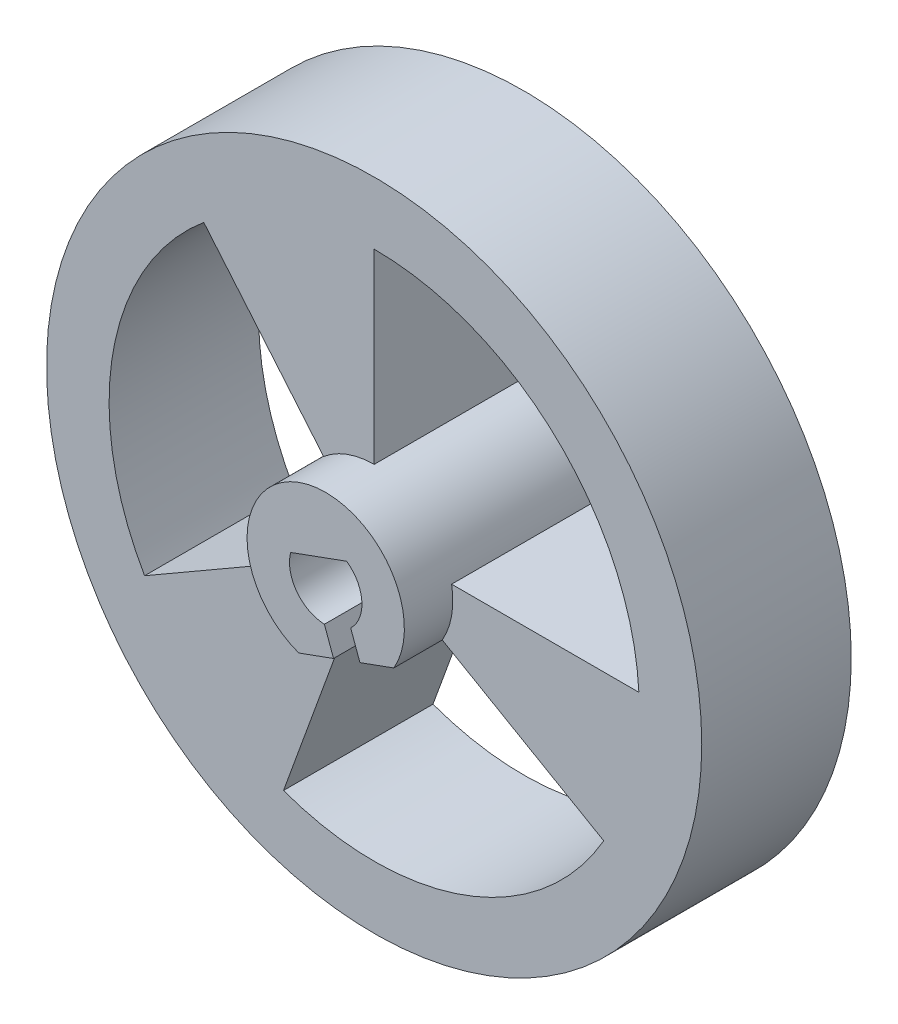
ISO-10303-21;
HEADER;
FILE_DESCRIPTION(('STEP AP214'),'2;1');
FILE_NAME('part.step','',(''),(''),'','','');
FILE_SCHEMA(('AUTOMOTIVE_DESIGN { 1 0 10303 214 1 1 1 1 }'));
ENDSEC;
DATA;
#1=APPLICATION_CONTEXT('core data for automotive mechanical design processes');
#2=APPLICATION_PROTOCOL_DEFINITION('international standard','automotive_design',2000,#1);
#3=PRODUCT_CONTEXT('',#1,'mechanical');
#4=PRODUCT('Part','Part','',(#3));
#5=PRODUCT_RELATED_PRODUCT_CATEGORY('part','',(#4));
#6=PRODUCT_DEFINITION_FORMATION('','',#4);
#7=PRODUCT_DEFINITION_CONTEXT('part definition',#1,'design');
#8=PRODUCT_DEFINITION('design','',#6,#7);
#9=PRODUCT_DEFINITION_SHAPE('','',#8);
#10=(LENGTH_UNIT() NAMED_UNIT(*) SI_UNIT(.MILLI.,.METRE.));
#11=(NAMED_UNIT(*) PLANE_ANGLE_UNIT() SI_UNIT($,.RADIAN.));
#12=(NAMED_UNIT(*) SI_UNIT($,.STERADIAN.) SOLID_ANGLE_UNIT());
#13=UNCERTAINTY_MEASURE_WITH_UNIT(LENGTH_MEASURE(1.E-05),#10,'distance_accuracy_value','');
#14=(GEOMETRIC_REPRESENTATION_CONTEXT(3) GLOBAL_UNCERTAINTY_ASSIGNED_CONTEXT((#13)) GLOBAL_UNIT_ASSIGNED_CONTEXT((#10,
#11,#12)) REPRESENTATION_CONTEXT('',''));
#15=CARTESIAN_POINT('',(0.,0.,0.));
#16=DIRECTION('',(0.,0.,1.));
#17=DIRECTION('',(1.,0.,0.));
#18=AXIS2_PLACEMENT_3D('',#15,#16,#17);
#19=CARTESIAN_POINT('',(15.4523335260827,-18.4153739936729,6.48));
#20=DIRECTION('',(-0.766044443118977,-0.642787609686541,0.));
#21=DIRECTION('',(0.642787609686541,-0.766044443118977,0.));
#22=AXIS2_PLACEMENT_3D('',#19,#20,#21);
#23=PLANE('',#22);
#24=DIRECTION('',(-0.642787609686541,0.766044443118977,0.));
#25=VECTOR('',#24,1.);
#26=CARTESIAN_POINT('',(15.4523335260827,-18.4153739936729,0.));
#27=LINE('',#26,#25);
#28=CARTESIAN_POINT('',(-2.1919057490311,2.61221155103571,0.));
#29=VERTEX_POINT('',#28);
#30=CARTESIAN_POINT('',(-7.38562963529835,8.80185065143704,0.));
#31=VERTEX_POINT('',#30);
#32=EDGE_CURVE('E259',#29,#31,#27,.T.);
#33=ORIENTED_EDGE('',*,*,#32,.F.);
#34=DIRECTION('',(0.,0.,-1.));
#35=VECTOR('',#34,1.);
#36=CARTESIAN_POINT('',(-2.1919057490311,2.61221155103571,6.48));
#37=LINE('',#36,#35);
#38=CARTESIAN_POINT('',(-2.1919057490311,2.61221155103571,6.48));
#39=VERTEX_POINT('',#38);
#40=EDGE_CURVE('E165',#39,#29,#37,.T.);
#41=ORIENTED_EDGE('',*,*,#40,.F.);
#42=DIRECTION('',(-0.642787609686541,0.766044443118977,0.));
#43=VECTOR('',#42,1.);
#44=CARTESIAN_POINT('',(15.4523335260827,-18.4153739936729,6.48));
#45=LINE('',#44,#43);
#46=CARTESIAN_POINT('',(-7.38562963529835,8.80185065143704,6.48));
#47=VERTEX_POINT('',#46);
#48=EDGE_CURVE('E173',#39,#47,#45,.T.);
#49=ORIENTED_EDGE('',*,*,#48,.T.);
#50=DIRECTION('',(0.,0.,-1.));
#51=VECTOR('',#50,1.);
#52=CARTESIAN_POINT('',(-7.38562963529835,8.80185065143704,6.48));
#53=LINE('',#52,#51);
#54=EDGE_CURVE('E54',#47,#31,#53,.T.);
#55=ORIENTED_EDGE('',*,*,#54,.T.);
#56=EDGE_LOOP('',(#33,#41,#49,#55));
#57=FACE_BOUND('',#56,.T.);
#58=ADVANCED_FACE('F35',(#57),#23,.T.);
#59=CARTESIAN_POINT('',(0.,0.,6.48));
#60=DIRECTION('',(0.,0.,-1.));
#61=DIRECTION('',(-1.,0.,0.));
#62=AXIS2_PLACEMENT_3D('',#59,#60,#61);
#63=CYLINDRICAL_SURFACE('',#62,3.41);
#64=CARTESIAN_POINT('',(0.,0.,0.));
#65=DIRECTION('',(0.,0.,1.));
#66=DIRECTION('',(1.,0.,0.));
#67=AXIS2_PLACEMENT_3D('',#64,#65,#66);
#68=CIRCLE('',#67,3.41);
#69=CARTESIAN_POINT('',(-2.95314662690495,-1.70499999999997,0.));
#70=VERTEX_POINT('',#69);
#71=EDGE_CURVE('E177',#29,#70,#68,.T.);
#72=ORIENTED_EDGE('',*,*,#71,.T.);
#73=DIRECTION('',(0.,0.,-1.));
#74=VECTOR('',#73,1.);
#75=CARTESIAN_POINT('',(-2.95314662690495,-1.70499999999997,6.48));
#76=LINE('',#75,#74);
#77=CARTESIAN_POINT('',(-2.95314662690495,-1.70499999999997,6.48));
#78=VERTEX_POINT('',#77);
#79=EDGE_CURVE('E170',#78,#70,#76,.T.);
#80=ORIENTED_EDGE('',*,*,#79,.F.);
#81=CARTESIAN_POINT('',(0.,0.,6.48));
#82=DIRECTION('',(0.,0.,1.));
#83=DIRECTION('',(1.,0.,0.));
#84=AXIS2_PLACEMENT_3D('',#81,#82,#83);
#85=CIRCLE('',#84,3.41);
#86=CARTESIAN_POINT('',(-1.16628868874053,-3.20435183687995,6.48));
#87=VERTEX_POINT('',#86);
#88=EDGE_CURVE('E45',#78,#87,#85,.T.);
#89=ORIENTED_EDGE('',*,*,#88,.T.);
#90=DIRECTION('',(0.,0.,-1.));
#91=VECTOR('',#90,1.);
#92=CARTESIAN_POINT('',(-1.16628868874053,-3.20435183687995,8.58));
#93=LINE('',#92,#91);
#94=CARTESIAN_POINT('',(-1.16628868874053,-3.20435183687995,8.58));
#95=VERTEX_POINT('',#94);
#96=EDGE_CURVE('E337',#95,#87,#93,.T.);
#97=ORIENTED_EDGE('',*,*,#96,.F.);
#98=CARTESIAN_POINT('',(0.,0.,8.58));
#99=DIRECTION('',(0.,0.,1.));
#100=DIRECTION('',(1.,0.,0.));
#101=AXIS2_PLACEMENT_3D('',#98,#99,#100);
#102=CIRCLE('',#101,3.41);
#103=CARTESIAN_POINT('',(2.95314662690493,-1.70500000000002,8.58));
#104=VERTEX_POINT('',#103);
#105=EDGE_CURVE('E325',#104,#95,#102,.T.);
#106=ORIENTED_EDGE('',*,*,#105,.F.);
#107=DIRECTION('',(0.,0.,-1.));
#108=VECTOR('',#107,1.);
#109=CARTESIAN_POINT('',(2.95314662690493,-1.70500000000002,8.58));
#110=LINE('',#109,#108);
#111=CARTESIAN_POINT('',(2.95314662690493,-1.70500000000001,6.48));
#112=VERTEX_POINT('',#111);
#113=EDGE_CURVE('E197',#104,#112,#110,.T.);
#114=ORIENTED_EDGE('',*,*,#113,.T.);
#115=CARTESIAN_POINT('',(3.35819443777163,0.592140285844221,6.48));
#116=VERTEX_POINT('',#115);
#117=EDGE_CURVE('E125',#112,#116,#85,.T.);
#118=ORIENTED_EDGE('',*,*,#117,.T.);
#119=DIRECTION('',(0.,0.,-1.));
#120=VECTOR('',#119,1.);
#121=CARTESIAN_POINT('',(3.35819443777163,0.592140285844221,6.48));
#122=LINE('',#121,#120);
#123=CARTESIAN_POINT('',(3.35819443777163,0.592140285844221,0.));
#124=VERTEX_POINT('',#123);
#125=EDGE_CURVE('E272',#116,#124,#122,.T.);
#126=ORIENTED_EDGE('',*,*,#125,.T.);
#127=CARTESIAN_POINT('',(0.,0.,0.));
#128=DIRECTION('',(0.,0.,1.));
#129=DIRECTION('',(1.,0.,0.));
#130=AXIS2_PLACEMENT_3D('',#127,#128,#129);
#131=CIRCLE('',#130,3.41);
#132=CARTESIAN_POINT('',(0.,3.41,0.));
#133=VERTEX_POINT('',#132);
#134=EDGE_CURVE('E250',#133,#124,#131,.F.);
#135=ORIENTED_EDGE('',*,*,#134,.F.);
#136=DIRECTION('',(0.,0.,-1.));
#137=VECTOR('',#136,1.);
#138=CARTESIAN_POINT('',(0.,3.41,6.48));
#139=LINE('',#138,#137);
#140=CARTESIAN_POINT('',(0.,3.41,6.48));
#141=VERTEX_POINT('',#140);
#142=EDGE_CURVE('E270',#141,#133,#139,.T.);
#143=ORIENTED_EDGE('',*,*,#142,.F.);
#144=EDGE_CURVE('E11',#141,#39,#85,.T.);
#145=ORIENTED_EDGE('',*,*,#144,.T.);
#146=ORIENTED_EDGE('',*,*,#40,.T.);
#147=EDGE_LOOP('',(#72,#80,#89,#97,#106,#114,#118,#126,#135,#143,#145,#146));
#148=FACE_BOUND('',#147,.T.);
#149=ADVANCED_FACE('F175',(#148),#63,.T.);
#150=CARTESIAN_POINT('',(-13.5885540506824,-7.84535533905907,6.48));
#151=DIRECTION('',(0.499999999999992,-0.866025403784443,0.));
#152=DIRECTION('',(0.866025403784443,0.499999999999992,0.));
#153=AXIS2_PLACEMENT_3D('',#150,#151,#152);
#154=PLANE('',#153);
#155=DIRECTION('',(-0.866025403784443,-0.499999999999992,0.));
#156=VECTOR('',#155,1.);
#157=CARTESIAN_POINT('',(-13.5885540506824,-7.84535533905907,0.));
#158=LINE('',#157,#156);
#159=CARTESIAN_POINT('',(-9.95063188948325,-5.74499999999991,0.));
#160=VERTEX_POINT('',#159);
#161=EDGE_CURVE('E262',#70,#160,#158,.T.);
#162=ORIENTED_EDGE('',*,*,#161,.T.);
#163=DIRECTION('',(0.,0.,-1.));
#164=VECTOR('',#163,1.);
#165=CARTESIAN_POINT('',(-9.95063188948325,-5.74499999999991,6.48));
#166=LINE('',#165,#164);
#167=CARTESIAN_POINT('',(-9.95063188948325,-5.74499999999991,6.48));
#168=VERTEX_POINT('',#167);
#169=EDGE_CURVE('E112',#168,#160,#166,.T.);
#170=ORIENTED_EDGE('',*,*,#169,.F.);
#171=DIRECTION('',(-0.866025403784443,-0.499999999999992,0.));
#172=VECTOR('',#171,1.);
#173=CARTESIAN_POINT('',(-13.5885540506824,-7.84535533905907,6.48));
#174=LINE('',#173,#172);
#175=EDGE_CURVE('E156',#78,#168,#174,.T.);
#176=ORIENTED_EDGE('',*,*,#175,.F.);
#177=ORIENTED_EDGE('',*,*,#79,.T.);
#178=EDGE_LOOP('',(#162,#170,#176,#177));
#179=FACE_BOUND('',#178,.T.);
#180=ADVANCED_FACE('F169',(#179),#154,.F.);
#181=CARTESIAN_POINT('',(0.,0.,6.48));
#182=DIRECTION('',(0.,0.,-1.));
#183=DIRECTION('',(-1.,0.,0.));
#184=AXIS2_PLACEMENT_3D('',#181,#182,#183);
#185=CYLINDRICAL_SURFACE('',#184,11.49);
#186=CARTESIAN_POINT('',(0.,0.,0.));
#187=DIRECTION('',(0.,0.,1.));
#188=DIRECTION('',(1.,0.,0.));
#189=AXIS2_PLACEMENT_3D('',#186,#187,#188);
#190=CIRCLE('',#189,11.49);
#191=CARTESIAN_POINT('',(11.4747317999978,0.592140285844221,0.));
#192=VERTEX_POINT('',#191);
#193=CARTESIAN_POINT('',(0.,11.49,0.));
#194=VERTEX_POINT('',#193);
#195=EDGE_CURVE('E244',#192,#194,#190,.T.);
#196=ORIENTED_EDGE('',*,*,#195,.F.);
#197=DIRECTION('',(0.,0.,-1.));
#198=VECTOR('',#197,1.);
#199=CARTESIAN_POINT('',(11.4747317999978,0.592140285844221,6.48));
#200=LINE('',#199,#198);
#201=CARTESIAN_POINT('',(11.4747317999978,0.592140285844221,6.48));
#202=VERTEX_POINT('',#201);
#203=EDGE_CURVE('E266',#202,#192,#200,.T.);
#204=ORIENTED_EDGE('',*,*,#203,.F.);
#205=CARTESIAN_POINT('',(0.,0.,6.48));
#206=DIRECTION('',(0.,0.,1.));
#207=DIRECTION('',(1.,0.,0.));
#208=AXIS2_PLACEMENT_3D('',#205,#206,#207);
#209=CIRCLE('',#208,11.49);
#210=CARTESIAN_POINT('',(0.,11.49,6.48));
#211=VERTEX_POINT('',#210);
#212=EDGE_CURVE('E206',#202,#211,#209,.T.);
#213=ORIENTED_EDGE('',*,*,#212,.T.);
#214=DIRECTION('',(0.,0.,-1.));
#215=VECTOR('',#214,1.);
#216=CARTESIAN_POINT('',(0.,11.49,6.48));
#217=LINE('',#216,#215);
#218=EDGE_CURVE('E268',#211,#194,#217,.T.);
#219=ORIENTED_EDGE('',*,*,#218,.T.);
#220=EDGE_LOOP('',(#196,#204,#213,#219));
#221=FACE_BOUND('',#220,.T.);
#222=ADVANCED_FACE('F399',(#221),#185,.F.);
#223=CARTESIAN_POINT('',(0.,0.592140285844221,6.48));
#224=DIRECTION('',(0.,1.,0.));
#225=DIRECTION('',(0.,0.,1.));
#226=AXIS2_PLACEMENT_3D('',#223,#224,#225);
#227=PLANE('',#226);
#228=DIRECTION('',(1.,0.,0.));
#229=VECTOR('',#228,1.);
#230=CARTESIAN_POINT('',(0.,0.592140285844221,0.));
#231=LINE('',#230,#229);
#232=EDGE_CURVE('E247',#124,#192,#231,.T.);
#233=ORIENTED_EDGE('',*,*,#232,.F.);
#234=ORIENTED_EDGE('',*,*,#125,.F.);
#235=DIRECTION('',(1.,0.,0.));
#236=VECTOR('',#235,1.);
#237=CARTESIAN_POINT('',(0.,0.592140285844221,6.48));
#238=LINE('',#237,#236);
#239=EDGE_CURVE('E209',#116,#202,#238,.T.);
#240=ORIENTED_EDGE('',*,*,#239,.T.);
#241=ORIENTED_EDGE('',*,*,#203,.T.);
#242=EDGE_LOOP('',(#233,#234,#240,#241));
#243=FACE_BOUND('',#242,.T.);
#244=ADVANCED_FACE('F396',(#243),#227,.T.);
#245=CARTESIAN_POINT('',(-9.19236544198871,-6.1256048729982,6.48));
#246=DIRECTION('',(0.342020143325667,-0.939692620785909,0.));
#247=DIRECTION('',(0.939692620785909,0.342020143325667,0.));
#248=AXIS2_PLACEMENT_3D('',#245,#246,#247);
#249=PLANE('',#248);
#250=DIRECTION('',(-0.939692620785909,-0.342020143325667,0.));
#251=VECTOR('',#250,1.);
#252=CARTESIAN_POINT('',(-9.19236544198871,-6.1256048729982,0.));
#253=LINE('',#252,#251);
#254=CARTESIAN_POINT('',(2.95314662690493,-1.70500000000001,0.));
#255=VERTEX_POINT('',#254);
#256=CARTESIAN_POINT('',(1.48342896908221,-2.23993348022293,0.));
#257=VERTEX_POINT('',#256);
#258=EDGE_CURVE('E216',#255,#257,#253,.T.);
#259=ORIENTED_EDGE('',*,*,#258,.F.);
#260=DIRECTION('',(0.,0.,-1.));
#261=VECTOR('',#260,1.);
#262=CARTESIAN_POINT('',(2.95314662690493,-1.70500000000001,6.48));
#263=LINE('',#262,#261);
#264=EDGE_CURVE('E189',#112,#255,#263,.T.);
#265=ORIENTED_EDGE('',*,*,#264,.F.);
#266=ORIENTED_EDGE('',*,*,#113,.F.);
#267=DIRECTION('',(0.939692620785907,0.342020143325673,0.));
#268=VECTOR('',#267,1.);
#269=CARTESIAN_POINT('',(1.48342896908221,-2.23993348022293,8.58));
#270=LINE('',#269,#268);
#271=CARTESIAN_POINT('',(1.48342896908221,-2.23993348022293,8.58));
#272=VERTEX_POINT('',#271);
#273=EDGE_CURVE('E307',#272,#104,#270,.T.);
#274=ORIENTED_EDGE('',*,*,#273,.F.);
#275=DIRECTION('',(0.,0.,-1.));
#276=VECTOR('',#275,1.);
#277=CARTESIAN_POINT('',(1.48342896908221,-2.23993348022293,6.48));
#278=LINE('',#277,#276);
#279=EDGE_CURVE('E215',#272,#257,#278,.T.);
#280=ORIENTED_EDGE('',*,*,#279,.T.);
#281=EDGE_LOOP('',(#259,#265,#266,#274,#280));
#282=FACE_BOUND('',#281,.T.);
#283=ADVANCED_FACE('F302',(#282),#249,.T.);
#284=CARTESIAN_POINT('',(13.5885540506826,-7.84535533905945,6.48));
#285=DIRECTION('',(0.500000000000004,0.866025403784436,0.));
#286=DIRECTION('',(-0.866025403784436,0.500000000000004,0.));
#287=AXIS2_PLACEMENT_3D('',#284,#285,#286);
#288=PLANE('',#287);
#289=DIRECTION('',(0.866025403784436,-0.500000000000004,0.));
#290=VECTOR('',#289,1.);
#291=CARTESIAN_POINT('',(13.5885540506826,-7.84535533905945,0.));
#292=LINE('',#291,#290);
#293=CARTESIAN_POINT('',(9.95063188948317,-5.74500000000005,0.));
#294=VERTEX_POINT('',#293);
#295=EDGE_CURVE('E219',#255,#294,#292,.T.);
#296=ORIENTED_EDGE('',*,*,#295,.T.);
#297=DIRECTION('',(0.,0.,-1.));
#298=VECTOR('',#297,1.);
#299=CARTESIAN_POINT('',(9.95063188948317,-5.74500000000005,6.48));
#300=LINE('',#299,#298);
#301=CARTESIAN_POINT('',(9.95063188948317,-5.74500000000005,6.48));
#302=VERTEX_POINT('',#301);
#303=EDGE_CURVE('E287',#302,#294,#300,.T.);
#304=ORIENTED_EDGE('',*,*,#303,.F.);
#305=DIRECTION('',(0.866025403784436,-0.500000000000004,0.));
#306=VECTOR('',#305,1.);
#307=CARTESIAN_POINT('',(13.5885540506826,-7.84535533905945,6.48));
#308=LINE('',#307,#306);
#309=EDGE_CURVE('E199',#112,#302,#308,.T.);
#310=ORIENTED_EDGE('',*,*,#309,.F.);
#311=ORIENTED_EDGE('',*,*,#264,.T.);
#312=EDGE_LOOP('',(#296,#304,#310,#311));
#313=FACE_BOUND('',#312,.T.);
#314=ADVANCED_FACE('F37',(#313),#288,.F.);
#315=CARTESIAN_POINT('',(0.,0.,6.48));
#316=DIRECTION('',(0.,0.,-1.));
#317=DIRECTION('',(-1.,0.,0.));
#318=AXIS2_PLACEMENT_3D('',#315,#316,#317);
#319=CYLINDRICAL_SURFACE('',#318,11.49);
#320=CARTESIAN_POINT('',(0.,0.,0.));
#321=DIRECTION('',(0.,0.,1.));
#322=DIRECTION('',(1.,0.,0.));
#323=AXIS2_PLACEMENT_3D('',#320,#321,#322);
#324=CIRCLE('',#323,11.49);
#325=CARTESIAN_POINT('',(-3.92981144681191,-10.7970682128301,0.));
#326=VERTEX_POINT('',#325);
#327=EDGE_CURVE('E223',#326,#294,#324,.T.);
#328=ORIENTED_EDGE('',*,*,#327,.F.);
#329=DIRECTION('',(0.,0.,-1.));
#330=VECTOR('',#329,1.);
#331=CARTESIAN_POINT('',(-3.92981144681191,-10.7970682128301,6.48));
#332=LINE('',#331,#330);
#333=CARTESIAN_POINT('',(-3.92981144681191,-10.7970682128301,6.48));
#334=VERTEX_POINT('',#333);
#335=EDGE_CURVE('E286',#334,#326,#332,.T.);
#336=ORIENTED_EDGE('',*,*,#335,.F.);
#337=CARTESIAN_POINT('',(0.,0.,6.48));
#338=DIRECTION('',(0.,0.,1.));
#339=DIRECTION('',(1.,0.,0.));
#340=AXIS2_PLACEMENT_3D('',#337,#338,#339);
#341=CIRCLE('',#340,11.49);
#342=EDGE_CURVE('E201',#334,#302,#341,.T.);
#343=ORIENTED_EDGE('',*,*,#342,.T.);
#344=ORIENTED_EDGE('',*,*,#303,.T.);
#345=EDGE_LOOP('',(#328,#336,#343,#344));
#346=FACE_BOUND('',#345,.T.);
#347=ADVANCED_FACE('F442',(#346),#319,.F.);
#348=CARTESIAN_POINT('',(-10.0857944110709,-27.7104924016791,6.48));
#349=DIRECTION('',(0.939692620785909,-0.342020143325667,0.));
#350=DIRECTION('',(0.342020143325667,0.939692620785909,0.));
#351=AXIS2_PLACEMENT_3D('',#348,#349,#350);
#352=PLANE('',#351);
#353=DIRECTION('',(-0.342020143325667,-0.939692620785909,0.));
#354=VECTOR('',#353,1.);
#355=CARTESIAN_POINT('',(-10.0857944110709,-27.7104924016791,0.));
#356=LINE('',#355,#354);
#357=CARTESIAN_POINT('',(-1.16628868874053,-3.20435183687995,0.));
#358=VERTEX_POINT('',#357);
#359=EDGE_CURVE('E226',#358,#326,#356,.T.);
#360=ORIENTED_EDGE('',*,*,#359,.F.);
#361=DIRECTION('',(0.,0.,-1.));
#362=VECTOR('',#361,1.);
#363=CARTESIAN_POINT('',(-1.16628868874053,-3.20435183687995,6.48));
#364=LINE('',#363,#362);
#365=EDGE_CURVE('E284',#87,#358,#364,.T.);
#366=ORIENTED_EDGE('',*,*,#365,.F.);
#367=DIRECTION('',(-0.342020143325667,-0.939692620785909,0.));
#368=VECTOR('',#367,1.);
#369=CARTESIAN_POINT('',(-10.0857944110709,-27.7104924016791,6.48));
#370=LINE('',#369,#368);
#371=EDGE_CURVE('E159',#87,#334,#370,.T.);
#372=ORIENTED_EDGE('',*,*,#371,.T.);
#373=ORIENTED_EDGE('',*,*,#335,.T.);
#374=EDGE_LOOP('',(#360,#366,#372,#373));
#375=FACE_BOUND('',#374,.T.);
#376=ADVANCED_FACE('F448',(#375),#352,.T.);
#377=CARTESIAN_POINT('',(0.339010322818524,-2.65646780300213,0.));
#378=VERTEX_POINT('',#377);
#379=EDGE_CURVE('E220',#378,#358,#253,.T.);
#380=ORIENTED_EDGE('',*,*,#379,.F.);
#381=DIRECTION('',(0.,0.,-1.));
#382=VECTOR('',#381,1.);
#383=CARTESIAN_POINT('',(0.339010322818524,-2.65646780300213,6.48));
#384=LINE('',#383,#382);
#385=CARTESIAN_POINT('',(0.339010322818524,-2.65646780300213,8.58));
#386=VERTEX_POINT('',#385);
#387=EDGE_CURVE('E282',#386,#378,#384,.T.);
#388=ORIENTED_EDGE('',*,*,#387,.F.);
#389=DIRECTION('',(0.939692620785911,0.342020143325662,0.));
#390=VECTOR('',#389,1.);
#391=CARTESIAN_POINT('',(0.339010322818524,-2.65646780300213,8.58));
#392=LINE('',#391,#390);
#393=EDGE_CURVE('E332',#95,#386,#392,.T.);
#394=ORIENTED_EDGE('',*,*,#393,.F.);
#395=ORIENTED_EDGE('',*,*,#96,.T.);
#396=ORIENTED_EDGE('',*,*,#365,.T.);
#397=EDGE_LOOP('',(#380,#388,#394,#395,#396));
#398=FACE_BOUND('',#397,.T.);
#399=ADVANCED_FACE('F436',(#398),#249,.T.);
#400=CARTESIAN_POINT('',(9.53137576480724,-27.9122842862412,6.48));
#401=DIRECTION('',(0.939692620785909,0.342020143325668,0.));
#402=DIRECTION('',(-0.342020143325668,0.939692620785909,0.));
#403=AXIS2_PLACEMENT_3D('',#400,#401,#402);
#404=PLANE('',#403);
#405=DIRECTION('',(0.342020143325668,-0.939692620785909,0.));
#406=VECTOR('',#405,1.);
#407=CARTESIAN_POINT('',(9.53137576480724,-27.9122842862412,0.));
#408=LINE('',#407,#406);
#409=CARTESIAN_POINT('',(-0.0568057832839673,-1.56897198922909,0.));
#410=VERTEX_POINT('',#409);
#411=EDGE_CURVE('E229',#410,#378,#408,.T.);
#412=ORIENTED_EDGE('',*,*,#411,.F.);
#413=DIRECTION('',(0.,0.,-1.));
#414=VECTOR('',#413,1.);
#415=CARTESIAN_POINT('',(-0.0568057832839673,-1.56897198922909,6.48));
#416=LINE('',#415,#414);
#417=CARTESIAN_POINT('',(-0.0568057832839673,-1.56897198922909,8.58));
#418=VERTEX_POINT('',#417);
#419=EDGE_CURVE('E280',#418,#410,#416,.T.);
#420=ORIENTED_EDGE('',*,*,#419,.F.);
#421=DIRECTION('',(-0.342020143325671,0.939692620785908,0.));
#422=VECTOR('',#421,1.);
#423=CARTESIAN_POINT('',(-0.0568057832839673,-1.56897198922909,8.58));
#424=LINE('',#423,#422);
#425=EDGE_CURVE('E335',#386,#418,#424,.T.);
#426=ORIENTED_EDGE('',*,*,#425,.F.);
#427=ORIENTED_EDGE('',*,*,#387,.T.);
#428=EDGE_LOOP('',(#412,#420,#426,#427));
#429=FACE_BOUND('',#428,.T.);
#430=ADVANCED_FACE('F352',(#429),#404,.T.);
#431=CARTESIAN_POINT('',(0.,0.,6.48));
#432=DIRECTION('',(0.,0.,-1.));
#433=DIRECTION('',(-1.,0.,0.));
#434=AXIS2_PLACEMENT_3D('',#431,#432,#433);
#435=CYLINDRICAL_SURFACE('',#434,1.57);
#436=CARTESIAN_POINT('',(0.,0.,0.));
#437=DIRECTION('',(0.,0.,1.));
#438=DIRECTION('',(1.,0.,0.));
#439=AXIS2_PLACEMENT_3D('',#436,#437,#438);
#440=CIRCLE('',#439,1.57);
#441=CARTESIAN_POINT('',(-1.51946574338497,0.395125112691618,0.));
#442=VERTEX_POINT('',#441);
#443=EDGE_CURVE('E232',#442,#410,#440,.T.);
#444=ORIENTED_EDGE('',*,*,#443,.F.);
#445=DIRECTION('',(0.,0.,-1.));
#446=VECTOR('',#445,1.);
#447=CARTESIAN_POINT('',(-1.51946574338497,0.395125112691618,6.48));
#448=LINE('',#447,#446);
#449=CARTESIAN_POINT('',(-1.51946574338497,0.395125112691618,8.58));
#450=VERTEX_POINT('',#449);
#451=EDGE_CURVE('E278',#450,#442,#448,.T.);
#452=ORIENTED_EDGE('',*,*,#451,.F.);
#453=CARTESIAN_POINT('',(0.,0.,8.58));
#454=DIRECTION('',(0.,0.,-1.));
#455=DIRECTION('',(1.,0.,0.));
#456=AXIS2_PLACEMENT_3D('',#453,#454,#455);
#457=CIRCLE('',#456,1.57);
#458=EDGE_CURVE('E196',#418,#450,#457,.T.);
#459=ORIENTED_EDGE('',*,*,#458,.F.);
#460=ORIENTED_EDGE('',*,*,#419,.T.);
#461=EDGE_LOOP('',(#444,#452,#459,#460));
#462=FACE_BOUND('',#461,.T.);
#463=ADVANCED_FACE('F358',(#462),#435,.F.);
#464=CARTESIAN_POINT('',(-10.3905289015056,-2.83367782315982,6.48));
#465=DIRECTION('',(-0.342020143325667,0.939692620785909,0.));
#466=DIRECTION('',(-0.939692620785909,-0.342020143325667,0.));
#467=AXIS2_PLACEMENT_3D('',#464,#465,#466);
#468=PLANE('',#467);
#469=DIRECTION('',(0.939692620785909,0.342020143325667,0.));
#470=VECTOR('',#469,1.);
#471=CARTESIAN_POINT('',(-10.3905289015056,-2.83367782315982,0.));
#472=LINE('',#471,#470);
#473=CARTESIAN_POINT('',(0.909996762515537,1.27937715010518,0.));
#474=VERTEX_POINT('',#473);
#475=EDGE_CURVE('E235',#442,#474,#472,.T.);
#476=ORIENTED_EDGE('',*,*,#475,.T.);
#477=DIRECTION('',(0.,0.,-1.));
#478=VECTOR('',#477,1.);
#479=CARTESIAN_POINT('',(0.909996762515537,1.27937715010518,6.48));
#480=LINE('',#479,#478);
#481=CARTESIAN_POINT('',(0.909996762515537,1.27937715010518,8.58));
#482=VERTEX_POINT('',#481);
#483=EDGE_CURVE('E276',#482,#474,#480,.T.);
#484=ORIENTED_EDGE('',*,*,#483,.F.);
#485=DIRECTION('',(0.939692620785909,0.342020143325668,0.));
#486=VECTOR('',#485,1.);
#487=CARTESIAN_POINT('',(-1.51946574338497,0.395125112691618,8.58));
#488=LINE('',#487,#486);
#489=EDGE_CURVE('E327',#450,#482,#488,.T.);
#490=ORIENTED_EDGE('',*,*,#489,.F.);
#491=ORIENTED_EDGE('',*,*,#451,.T.);
#492=EDGE_LOOP('',(#476,#484,#490,#491));
#493=FACE_BOUND('',#492,.T.);
#494=ADVANCED_FACE('F371',(#493),#468,.F.);
#495=CARTESIAN_POINT('',(0.,0.,6.48));
#496=DIRECTION('',(0.,0.,-1.));
#497=DIRECTION('',(-1.,0.,0.));
#498=AXIS2_PLACEMENT_3D('',#495,#496,#497);
#499=CYLINDRICAL_SURFACE('',#498,1.57);
#500=CARTESIAN_POINT('',(0.,0.,0.));
#501=DIRECTION('',(0.,0.,1.));
#502=DIRECTION('',(1.,0.,0.));
#503=AXIS2_PLACEMENT_3D('',#500,#501,#502);
#504=CIRCLE('',#503,1.57);
#505=CARTESIAN_POINT('',(1.0821627894372,-1.13746371245746,0.));
#506=VERTEX_POINT('',#505);
#507=EDGE_CURVE('E238',#506,#474,#504,.T.);
#508=ORIENTED_EDGE('',*,*,#507,.F.);
#509=DIRECTION('',(0.,0.,-1.));
#510=VECTOR('',#509,1.);
#511=CARTESIAN_POINT('',(1.0821627894372,-1.13746371245746,6.48));
#512=LINE('',#511,#510);
#513=CARTESIAN_POINT('',(1.0821627894372,-1.13746371245746,8.58));
#514=VERTEX_POINT('',#513);
#515=EDGE_CURVE('E274',#514,#506,#512,.T.);
#516=ORIENTED_EDGE('',*,*,#515,.F.);
#517=CARTESIAN_POINT('',(0.,0.,8.58));
#518=DIRECTION('',(0.,0.,-1.));
#519=DIRECTION('',(1.,0.,0.));
#520=AXIS2_PLACEMENT_3D('',#517,#518,#519);
#521=CIRCLE('',#520,1.57);
#522=EDGE_CURVE('E323',#482,#514,#521,.T.);
#523=ORIENTED_EDGE('',*,*,#522,.F.);
#524=ORIENTED_EDGE('',*,*,#483,.T.);
#525=EDGE_LOOP('',(#508,#516,#523,#524));
#526=FACE_BOUND('',#525,.T.);
#527=ADVANCED_FACE('F368',(#526),#499,.F.);
#528=CARTESIAN_POINT('',(0.,0.,6.48));
#529=DIRECTION('',(0.,0.,-1.));
#530=DIRECTION('',(-1.,0.,0.));
#531=AXIS2_PLACEMENT_3D('',#528,#529,#530);
#532=CYLINDRICAL_SURFACE('',#531,14.2);
#533=CARTESIAN_POINT('',(0.,0.,6.48));
#534=DIRECTION('',(0.,0.,1.));
#535=DIRECTION('',(1.,0.,0.));
#536=AXIS2_PLACEMENT_3D('',#533,#534,#535);
#537=CIRCLE('',#536,14.2);
#538=CARTESIAN_POINT('',(14.2,0.,6.48));
#539=VERTEX_POINT('',#538);
#540=EDGE_CURVE('E210',#539,#539,#537,.T.);
#541=ORIENTED_EDGE('',*,*,#540,.F.);
#542=EDGE_LOOP('',(#541));
#543=FACE_BOUND('',#542,.T.);
#544=CARTESIAN_POINT('',(0.,0.,0.));
#545=DIRECTION('',(0.,0.,1.));
#546=DIRECTION('',(1.,0.,0.));
#547=AXIS2_PLACEMENT_3D('',#544,#545,#546);
#548=CIRCLE('',#547,14.2);
#549=CARTESIAN_POINT('',(14.2,0.,0.));
#550=VERTEX_POINT('',#549);
#551=EDGE_CURVE('E256',#550,#550,#548,.T.);
#552=ORIENTED_EDGE('',*,*,#551,.T.);
#553=EDGE_LOOP('',(#552));
#554=FACE_BOUND('',#553,.T.);
#555=ADVANCED_FACE('F378',(#543,#554),#532,.T.);
#556=CARTESIAN_POINT('',(0.,-31.3814213562373,6.48));
#557=DIRECTION('',(1.,0.,0.));
#558=DIRECTION('',(0.,0.,-1.));
#559=AXIS2_PLACEMENT_3D('',#556,#557,#558);
#560=PLANE('',#559);
#561=DIRECTION('',(0.,-1.,0.));
#562=VECTOR('',#561,1.);
#563=CARTESIAN_POINT('',(0.,-31.3814213562373,0.));
#564=LINE('',#563,#562);
#565=EDGE_CURVE('E253',#194,#133,#564,.T.);
#566=ORIENTED_EDGE('',*,*,#565,.F.);
#567=ORIENTED_EDGE('',*,*,#218,.F.);
#568=DIRECTION('',(0.,-1.,0.));
#569=VECTOR('',#568,1.);
#570=CARTESIAN_POINT('',(0.,-31.3814213562373,6.48));
#571=LINE('',#570,#569);
#572=EDGE_CURVE('E213',#211,#141,#571,.T.);
#573=ORIENTED_EDGE('',*,*,#572,.T.);
#574=ORIENTED_EDGE('',*,*,#142,.T.);
#575=EDGE_LOOP('',(#566,#567,#573,#574));
#576=FACE_BOUND('',#575,.T.);
#577=ADVANCED_FACE('F391',(#576),#560,.T.);
#578=CARTESIAN_POINT('',(10.6757944110709,-27.495749963462,6.48));
#579=DIRECTION('',(-0.939692620785909,-0.342020143325667,0.));
#580=DIRECTION('',(0.342020143325667,-0.939692620785909,0.));
#581=AXIS2_PLACEMENT_3D('',#578,#579,#580);
#582=PLANE('',#581);
#583=DIRECTION('',(-0.342020143325667,0.939692620785909,0.));
#584=VECTOR('',#583,1.);
#585=CARTESIAN_POINT('',(10.6757944110709,-27.495749963462,0.));
#586=LINE('',#585,#584);
#587=EDGE_CURVE('E241',#257,#506,#586,.T.);
#588=ORIENTED_EDGE('',*,*,#587,.F.);
#589=ORIENTED_EDGE('',*,*,#279,.F.);
#590=DIRECTION('',(0.342020143325667,-0.939692620785909,0.));
#591=VECTOR('',#590,1.);
#592=CARTESIAN_POINT('',(1.0821627894372,-1.13746371245746,8.58));
#593=LINE('',#592,#591);
#594=EDGE_CURVE('E313',#514,#272,#593,.T.);
#595=ORIENTED_EDGE('',*,*,#594,.F.);
#596=ORIENTED_EDGE('',*,*,#515,.T.);
#597=EDGE_LOOP('',(#588,#589,#595,#596));
#598=FACE_BOUND('',#597,.T.);
#599=ADVANCED_FACE('F311',(#598),#582,.T.);
#600=CARTESIAN_POINT('',(0.,0.,6.48));
#601=DIRECTION('',(0.,0.,-1.));
#602=DIRECTION('',(-1.,0.,0.));
#603=AXIS2_PLACEMENT_3D('',#600,#601,#602);
#604=CYLINDRICAL_SURFACE('',#603,11.49);
#605=CARTESIAN_POINT('',(0.,0.,0.));
#606=DIRECTION('',(0.,0.,1.));
#607=DIRECTION('',(1.,0.,0.));
#608=AXIS2_PLACEMENT_3D('',#605,#606,#607);
#609=CIRCLE('',#608,11.49);
#610=EDGE_CURVE('E202',#31,#160,#609,.T.);
#611=ORIENTED_EDGE('',*,*,#610,.F.);
#612=ORIENTED_EDGE('',*,*,#54,.F.);
#613=CARTESIAN_POINT('',(0.,0.,6.48));
#614=DIRECTION('',(0.,0.,1.));
#615=DIRECTION('',(1.,0.,0.));
#616=AXIS2_PLACEMENT_3D('',#613,#614,#615);
#617=CIRCLE('',#616,11.49);
#618=EDGE_CURVE('E172',#47,#168,#617,.T.);
#619=ORIENTED_EDGE('',*,*,#618,.T.);
#620=ORIENTED_EDGE('',*,*,#169,.T.);
#621=EDGE_LOOP('',(#611,#612,#619,#620));
#622=FACE_BOUND('',#621,.T.);
#623=ADVANCED_FACE('F405',(#622),#604,.F.);
#624=CARTESIAN_POINT('',(0.,-31.3814213562373,6.48));
#625=DIRECTION('',(0.,0.,1.));
#626=DIRECTION('',(1.,0.,0.));
#627=AXIS2_PLACEMENT_3D('',#624,#625,#626);
#628=PLANE('',#627);
#629=ORIENTED_EDGE('',*,*,#117,.F.);
#630=ORIENTED_EDGE('',*,*,#309,.T.);
#631=ORIENTED_EDGE('',*,*,#342,.F.);
#632=ORIENTED_EDGE('',*,*,#371,.F.);
#633=ORIENTED_EDGE('',*,*,#88,.F.);
#634=ORIENTED_EDGE('',*,*,#175,.T.);
#635=ORIENTED_EDGE('',*,*,#618,.F.);
#636=ORIENTED_EDGE('',*,*,#48,.F.);
#637=ORIENTED_EDGE('',*,*,#144,.F.);
#638=ORIENTED_EDGE('',*,*,#572,.F.);
#639=ORIENTED_EDGE('',*,*,#212,.F.);
#640=ORIENTED_EDGE('',*,*,#239,.F.);
#641=EDGE_LOOP('',(#629,#630,#631,#632,#633,#634,#635,#636,#637,#638,#639,#640));
#642=FACE_BOUND('',#641,.T.);
#643=ORIENTED_EDGE('',*,*,#540,.T.);
#644=EDGE_LOOP('',(#643));
#645=FACE_BOUND('',#644,.T.);
#646=ADVANCED_FACE('F153',(#642,#645),#628,.T.);
#647=CARTESIAN_POINT('',(0.,-31.3814213562373,0.));
#648=DIRECTION('',(0.,0.,1.));
#649=DIRECTION('',(1.,0.,0.));
#650=AXIS2_PLACEMENT_3D('',#647,#648,#649);
#651=PLANE('',#650);
#652=ORIENTED_EDGE('',*,*,#258,.T.);
#653=ORIENTED_EDGE('',*,*,#587,.T.);
#654=ORIENTED_EDGE('',*,*,#507,.T.);
#655=ORIENTED_EDGE('',*,*,#475,.F.);
#656=ORIENTED_EDGE('',*,*,#443,.T.);
#657=ORIENTED_EDGE('',*,*,#411,.T.);
#658=ORIENTED_EDGE('',*,*,#379,.T.);
#659=ORIENTED_EDGE('',*,*,#359,.T.);
#660=ORIENTED_EDGE('',*,*,#327,.T.);
#661=ORIENTED_EDGE('',*,*,#295,.F.);
#662=EDGE_LOOP('',(#652,#653,#654,#655,#656,#657,#658,#659,#660,#661));
#663=FACE_BOUND('',#662,.T.);
#664=ORIENTED_EDGE('',*,*,#195,.T.);
#665=ORIENTED_EDGE('',*,*,#565,.T.);
#666=ORIENTED_EDGE('',*,*,#134,.T.);
#667=ORIENTED_EDGE('',*,*,#232,.T.);
#668=EDGE_LOOP('',(#664,#665,#666,#667));
#669=FACE_BOUND('',#668,.T.);
#670=ORIENTED_EDGE('',*,*,#551,.F.);
#671=EDGE_LOOP('',(#670));
#672=FACE_BOUND('',#671,.T.);
#673=ORIENTED_EDGE('',*,*,#32,.T.);
#674=ORIENTED_EDGE('',*,*,#610,.T.);
#675=ORIENTED_EDGE('',*,*,#161,.F.);
#676=ORIENTED_EDGE('',*,*,#71,.F.);
#677=EDGE_LOOP('',(#673,#674,#675,#676));
#678=FACE_BOUND('',#677,.T.);
#679=ADVANCED_FACE('F299',(#663,#669,#672,#678),#651,.F.);
#680=CARTESIAN_POINT('',(0.,0.,8.58));
#681=DIRECTION('',(0.,0.,1.));
#682=DIRECTION('',(1.,0.,0.));
#683=AXIS2_PLACEMENT_3D('',#680,#681,#682);
#684=PLANE('',#683);
#685=ORIENTED_EDGE('',*,*,#458,.T.);
#686=ORIENTED_EDGE('',*,*,#489,.T.);
#687=ORIENTED_EDGE('',*,*,#522,.T.);
#688=ORIENTED_EDGE('',*,*,#594,.T.);
#689=ORIENTED_EDGE('',*,*,#273,.T.);
#690=ORIENTED_EDGE('',*,*,#105,.T.);
#691=ORIENTED_EDGE('',*,*,#393,.T.);
#692=ORIENTED_EDGE('',*,*,#425,.T.);
#693=EDGE_LOOP('',(#685,#686,#687,#688,#689,#690,#691,#692));
#694=FACE_BOUND('',#693,.T.);
#695=ADVANCED_FACE('F319',(#694),#684,.T.);
#696=CLOSED_SHELL('',(#58,#149,#180,#222,#244,#283,#314,#347,#376,#399,#430,#463,#494,#527,#555,
#577,#599,#623,#646,#679,#695));
#697=MANIFOLD_SOLID_BREP('B2',#696);
#698=ADVANCED_BREP_SHAPE_REPRESENTATION('',(#18,#697),#14);
#699=SHAPE_DEFINITION_REPRESENTATION(#9,#698);
ENDSEC;
END-ISO-10303-21;
